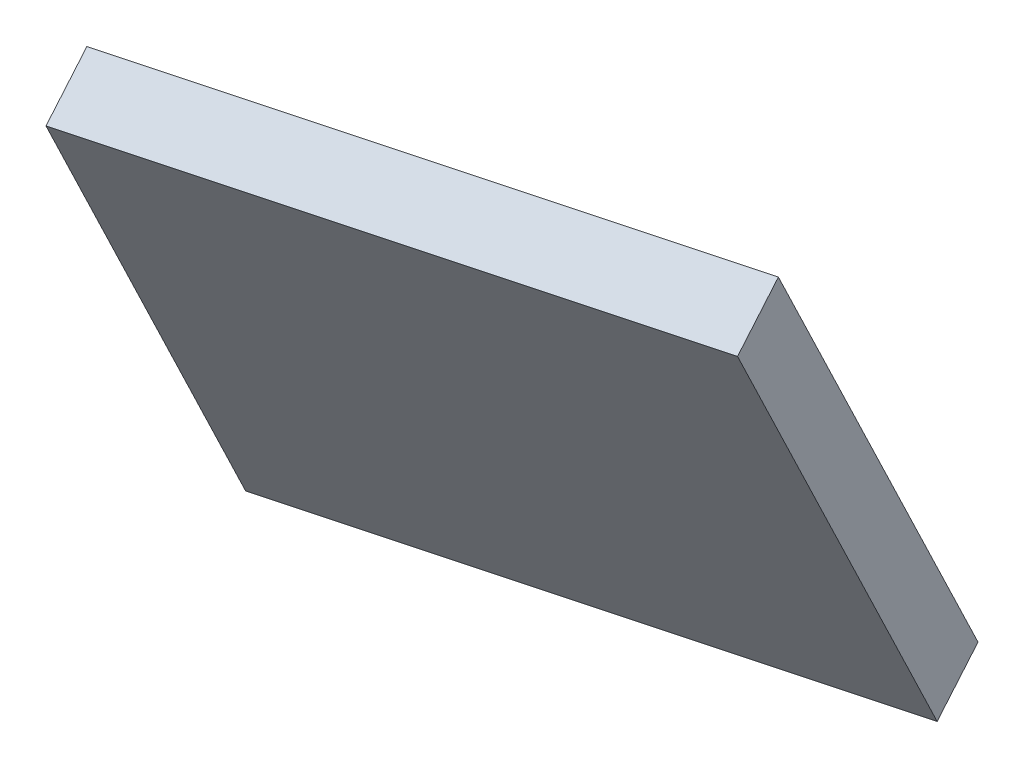
ISO-10303-21;
HEADER;
FILE_DESCRIPTION(('STEP AP214'),'2;1');
FILE_NAME('part.step','',(''),(''),'','','');
FILE_SCHEMA(('AUTOMOTIVE_DESIGN { 1 0 10303 214 1 1 1 1 }'));
ENDSEC;
DATA;
#1=APPLICATION_CONTEXT('core data for automotive mechanical design processes');
#2=APPLICATION_PROTOCOL_DEFINITION('international standard','automotive_design',2000,#1);
#3=PRODUCT_CONTEXT('',#1,'mechanical');
#4=PRODUCT('Part','Part','',(#3));
#5=PRODUCT_RELATED_PRODUCT_CATEGORY('part','',(#4));
#6=PRODUCT_DEFINITION_FORMATION('','',#4);
#7=PRODUCT_DEFINITION_CONTEXT('part definition',#1,'design');
#8=PRODUCT_DEFINITION('design','',#6,#7);
#9=PRODUCT_DEFINITION_SHAPE('','',#8);
#10=(LENGTH_UNIT() NAMED_UNIT(*) SI_UNIT(.MILLI.,.METRE.));
#11=(NAMED_UNIT(*) PLANE_ANGLE_UNIT() SI_UNIT($,.RADIAN.));
#12=(NAMED_UNIT(*) SI_UNIT($,.STERADIAN.) SOLID_ANGLE_UNIT());
#13=UNCERTAINTY_MEASURE_WITH_UNIT(LENGTH_MEASURE(1.E-05),#10,'distance_accuracy_value','');
#14=(GEOMETRIC_REPRESENTATION_CONTEXT(3) GLOBAL_UNCERTAINTY_ASSIGNED_CONTEXT((#13)) GLOBAL_UNIT_ASSIGNED_CONTEXT((#10,
#11,#12)) REPRESENTATION_CONTEXT('',''));
#15=CARTESIAN_POINT('',(0.,0.,0.));
#16=DIRECTION('',(0.,0.,1.));
#17=DIRECTION('',(1.,0.,0.));
#18=AXIS2_PLACEMENT_3D('',#15,#16,#17);
#19=CARTESIAN_POINT('',(17.6034737959342,52.25,7.9677725828047));
#20=DIRECTION('',(0.12940952255126,0.866025403784439,0.482962913144534));
#21=DIRECTION('',(0.965925826289068,0.,-0.25881904510252));
#22=AXIS2_PLACEMENT_3D('',#19,#20,#21);
#23=PLANE('',#22);
#24=DIRECTION('',(-0.965925826289068,0.,0.258819045102521));
#25=VECTOR('',#24,1.);
#26=CARTESIAN_POINT('',(30.2069475918684,51.5,5.9355451656094));
#27=LINE('',#26,#25);
#28=CARTESIAN_POINT('',(30.2069475918684,51.5,5.9355451656094));
#29=VERTEX_POINT('',#28);
#30=CARTESIAN_POINT('',(5.67243160412604,51.5,12.5095489112134));
#31=VERTEX_POINT('',#30);
#32=EDGE_CURVE('E28',#29,#31,#27,.T.);
#33=ORIENTED_EDGE('',*,*,#32,.T.);
#34=DIRECTION('',(-0.224143868042013,0.5,-0.836516303737808));
#35=VECTOR('',#34,1.);
#36=CARTESIAN_POINT('',(5.67243160412604,51.5,12.5095489112134));
#37=LINE('',#36,#35);
#38=CARTESIAN_POINT('',(5.,53.,10.));
#39=VERTEX_POINT('',#38);
#40=EDGE_CURVE('E92',#31,#39,#37,.T.);
#41=ORIENTED_EDGE('',*,*,#40,.T.);
#42=DIRECTION('',(0.965925826289068,0.,-0.258819045102521));
#43=VECTOR('',#42,1.);
#44=CARTESIAN_POINT('',(5.,53.,10.));
#45=LINE('',#44,#43);
#46=CARTESIAN_POINT('',(29.5345159877423,53.,3.42599625439597));
#47=VERTEX_POINT('',#46);
#48=EDGE_CURVE('E75',#39,#47,#45,.T.);
#49=ORIENTED_EDGE('',*,*,#48,.T.);
#50=DIRECTION('',(0.224143868042013,-0.5,0.836516303737808));
#51=VECTOR('',#50,1.);
#52=CARTESIAN_POINT('',(29.5345159877423,53.,3.42599625439597));
#53=LINE('',#52,#51);
#54=EDGE_CURVE('E86',#47,#29,#53,.T.);
#55=ORIENTED_EDGE('',*,*,#54,.T.);
#56=EDGE_LOOP('',(#33,#41,#49,#55));
#57=FACE_BOUND('',#56,.T.);
#58=ADVANCED_FACE('F17',(#57),#23,.F.);
#59=CARTESIAN_POINT('',(20.8904756687362,74.2470452561247,20.2350305766759));
#60=DIRECTION('',(0.12940952255126,0.866025403784439,0.482962913144534));
#61=DIRECTION('',(0.965925826289068,0.,-0.25881904510252));
#62=AXIS2_PLACEMENT_3D('',#59,#60,#61);
#63=PLANE('',#62);
#64=DIRECTION('',(0.965925826289068,0.,-0.258819045102521));
#65=VECTOR('',#64,1.);
#66=CARTESIAN_POINT('',(33.4939494646704,73.4970452561247,18.2028031594806));
#67=LINE('',#66,#65);
#68=CARTESIAN_POINT('',(8.95943347692805,73.4970452561247,24.7768069050846));
#69=VERTEX_POINT('',#68);
#70=CARTESIAN_POINT('',(33.4939494646704,73.4970452561247,18.2028031594806));
#71=VERTEX_POINT('',#70);
#72=EDGE_CURVE('E11',#69,#71,#67,.T.);
#73=ORIENTED_EDGE('',*,*,#72,.T.);
#74=DIRECTION('',(-0.224143868042013,0.5,-0.836516303737808));
#75=VECTOR('',#74,1.);
#76=CARTESIAN_POINT('',(32.8215178605443,74.9970452561247,15.6932542482671));
#77=LINE('',#76,#75);
#78=CARTESIAN_POINT('',(32.8215178605443,74.9970452561247,15.6932542482671));
#79=VERTEX_POINT('',#78);
#80=EDGE_CURVE('E21',#71,#79,#77,.T.);
#81=ORIENTED_EDGE('',*,*,#80,.T.);
#82=DIRECTION('',(-0.965925826289068,0.,0.258819045102521));
#83=VECTOR('',#82,1.);
#84=CARTESIAN_POINT('',(8.28700187280201,74.9970452561247,22.2672579938712));
#85=LINE('',#84,#83);
#86=CARTESIAN_POINT('',(8.28700187280201,74.9970452561247,22.2672579938712));
#87=VERTEX_POINT('',#86);
#88=EDGE_CURVE('E62',#79,#87,#85,.T.);
#89=ORIENTED_EDGE('',*,*,#88,.T.);
#90=DIRECTION('',(0.224143868042013,-0.5,0.836516303737808));
#91=VECTOR('',#90,1.);
#92=CARTESIAN_POINT('',(8.95943347692805,73.4970452561247,24.7768069050846));
#93=LINE('',#92,#91);
#94=EDGE_CURVE('E93',#87,#69,#93,.T.);
#95=ORIENTED_EDGE('',*,*,#94,.T.);
#96=EDGE_LOOP('',(#73,#81,#89,#95));
#97=FACE_BOUND('',#96,.T.);
#98=ADVANCED_FACE('F187',(#97),#63,.T.);
#99=CARTESIAN_POINT('',(5.67243160412604,51.5,12.5095489112134));
#100=DIRECTION('',(0.224143868042013,-0.5,0.836516303737808));
#101=DIRECTION('',(-0.912505280081001,-0.409064926172232,0.));
#102=AXIS2_PLACEMENT_3D('',#99,#100,#101);
#103=PLANE('',#102);
#104=DIRECTION('',(0.12940952255126,0.866025403784439,0.482962913144534));
#105=VECTOR('',#104,1.);
#106=CARTESIAN_POINT('',(5.67243160412604,51.5,12.5095489112134));
#107=LINE('',#106,#105);
#108=EDGE_CURVE('E96',#31,#69,#107,.T.);
#109=ORIENTED_EDGE('',*,*,#108,.F.);
#110=ORIENTED_EDGE('',*,*,#32,.F.);
#111=DIRECTION('',(0.12940952255126,0.866025403784439,0.482962913144534));
#112=VECTOR('',#111,1.);
#113=CARTESIAN_POINT('',(30.2069475918684,51.5,5.9355451656094));
#114=LINE('',#113,#112);
#115=EDGE_CURVE('E105',#29,#71,#114,.T.);
#116=ORIENTED_EDGE('',*,*,#115,.T.);
#117=ORIENTED_EDGE('',*,*,#72,.F.);
#118=EDGE_LOOP('',(#109,#110,#116,#117));
#119=FACE_BOUND('',#118,.T.);
#120=ADVANCED_FACE('F181',(#119),#103,.T.);
#121=CARTESIAN_POINT('',(30.2069475918684,51.5,5.9355451656094));
#122=DIRECTION('',(0.965925826289068,0.,-0.258819045102521));
#123=DIRECTION('',(0.,-1.,0.));
#124=AXIS2_PLACEMENT_3D('',#121,#122,#123);
#125=PLANE('',#124);
#126=ORIENTED_EDGE('',*,*,#54,.F.);
#127=DIRECTION('',(0.12940952255126,0.866025403784439,0.482962913144534));
#128=VECTOR('',#127,1.);
#129=CARTESIAN_POINT('',(29.5345159877423,53.,3.42599625439597));
#130=LINE('',#129,#128);
#131=EDGE_CURVE('E81',#47,#79,#130,.T.);
#132=ORIENTED_EDGE('',*,*,#131,.T.);
#133=ORIENTED_EDGE('',*,*,#80,.F.);
#134=ORIENTED_EDGE('',*,*,#115,.F.);
#135=EDGE_LOOP('',(#126,#132,#133,#134));
#136=FACE_BOUND('',#135,.T.);
#137=ADVANCED_FACE('F19',(#136),#125,.T.);
#138=CARTESIAN_POINT('',(29.5345159877423,53.,3.42599625439597));
#139=DIRECTION('',(-0.224143868042013,0.5,-0.836516303737808));
#140=DIRECTION('',(-0.965925826289068,0.,0.258819045102521));
#141=AXIS2_PLACEMENT_3D('',#138,#139,#140);
#142=PLANE('',#141);
#143=DIRECTION('',(0.12940952255126,0.866025403784439,0.482962913144534));
#144=VECTOR('',#143,1.);
#145=CARTESIAN_POINT('',(5.,53.,10.));
#146=LINE('',#145,#144);
#147=EDGE_CURVE('E78',#39,#87,#146,.T.);
#148=ORIENTED_EDGE('',*,*,#147,.T.);
#149=ORIENTED_EDGE('',*,*,#88,.F.);
#150=ORIENTED_EDGE('',*,*,#131,.F.);
#151=ORIENTED_EDGE('',*,*,#48,.F.);
#152=EDGE_LOOP('',(#148,#149,#150,#151));
#153=FACE_BOUND('',#152,.T.);
#154=ADVANCED_FACE('F77',(#153),#142,.T.);
#155=CARTESIAN_POINT('',(5.,53.,10.));
#156=DIRECTION('',(-0.965925826289068,0.,0.258819045102521));
#157=DIRECTION('',(0.,1.,0.));
#158=AXIS2_PLACEMENT_3D('',#155,#156,#157);
#159=PLANE('',#158);
#160=ORIENTED_EDGE('',*,*,#40,.F.);
#161=ORIENTED_EDGE('',*,*,#108,.T.);
#162=ORIENTED_EDGE('',*,*,#94,.F.);
#163=ORIENTED_EDGE('',*,*,#147,.F.);
#164=EDGE_LOOP('',(#160,#161,#162,#163));
#165=FACE_BOUND('',#164,.T.);
#166=ADVANCED_FACE('F90',(#165),#159,.T.);
#167=CLOSED_SHELL('',(#58,#98,#120,#137,#154,#166));
#168=MANIFOLD_SOLID_BREP('B1',#167);
#169=ADVANCED_BREP_SHAPE_REPRESENTATION('',(#18,#168),#14);
#170=SHAPE_DEFINITION_REPRESENTATION(#9,#169);
ENDSEC;
END-ISO-10303-21;
